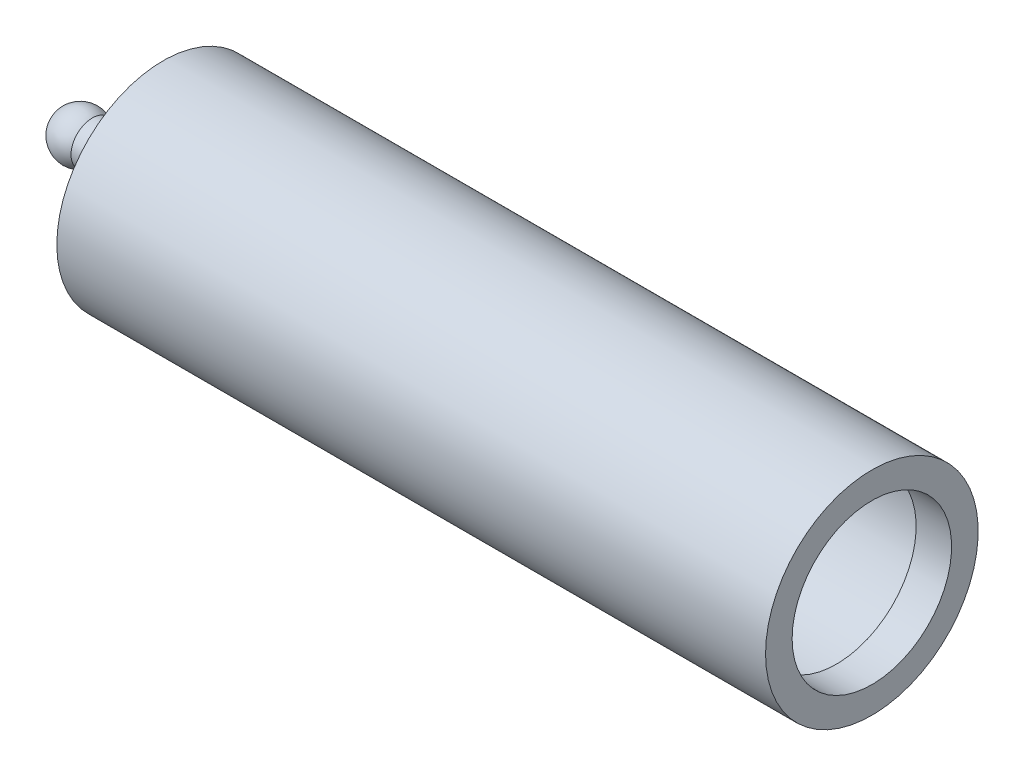
ISO-10303-21;
HEADER;
FILE_DESCRIPTION(('STEP AP214'),'2;1');
FILE_NAME('part.step','',(''),(''),'','','');
FILE_SCHEMA(('AUTOMOTIVE_DESIGN { 1 0 10303 214 1 1 1 1 }'));
ENDSEC;
DATA;
#1=APPLICATION_CONTEXT('core data for automotive mechanical design processes');
#2=APPLICATION_PROTOCOL_DEFINITION('international standard','automotive_design',2000,#1);
#3=PRODUCT_CONTEXT('',#1,'mechanical');
#4=PRODUCT('Part','Part','',(#3));
#5=PRODUCT_RELATED_PRODUCT_CATEGORY('part','',(#4));
#6=PRODUCT_DEFINITION_FORMATION('','',#4);
#7=PRODUCT_DEFINITION_CONTEXT('part definition',#1,'design');
#8=PRODUCT_DEFINITION('design','',#6,#7);
#9=PRODUCT_DEFINITION_SHAPE('','',#8);
#10=(LENGTH_UNIT() NAMED_UNIT(*) SI_UNIT(.MILLI.,.METRE.));
#11=(NAMED_UNIT(*) PLANE_ANGLE_UNIT() SI_UNIT($,.RADIAN.));
#12=(NAMED_UNIT(*) SI_UNIT($,.STERADIAN.) SOLID_ANGLE_UNIT());
#13=UNCERTAINTY_MEASURE_WITH_UNIT(LENGTH_MEASURE(1.E-05),#10,'distance_accuracy_value','');
#14=(GEOMETRIC_REPRESENTATION_CONTEXT(3) GLOBAL_UNCERTAINTY_ASSIGNED_CONTEXT((#13)) GLOBAL_UNIT_ASSIGNED_CONTEXT((#10,
#11,#12)) REPRESENTATION_CONTEXT('',''));
#15=CARTESIAN_POINT('',(0.,0.,0.));
#16=DIRECTION('',(0.,0.,1.));
#17=DIRECTION('',(1.,0.,0.));
#18=AXIS2_PLACEMENT_3D('',#15,#16,#17);
#19=CARTESIAN_POINT('',(-220.,0.,0.));
#20=DIRECTION('',(-1.,0.,0.));
#21=DIRECTION('',(0.,0.,1.));
#22=AXIS2_PLACEMENT_3D('',#19,#20,#21);
#23=CYLINDRICAL_SURFACE('',#22,55.);
#24=CARTESIAN_POINT('',(200.,0.,0.));
#25=DIRECTION('',(-1.,0.,0.));
#26=DIRECTION('',(0.,0.,1.));
#27=AXIS2_PLACEMENT_3D('',#24,#25,#26);
#28=CIRCLE('',#27,55.);
#29=CARTESIAN_POINT('',(200.,0.,55.));
#30=VERTEX_POINT('',#29);
#31=EDGE_CURVE('E70',#30,#30,#28,.T.);
#32=ORIENTED_EDGE('',*,*,#31,.F.);
#33=EDGE_LOOP('',(#32));
#34=FACE_BOUND('',#33,.T.);
#35=CARTESIAN_POINT('',(-160.,0.,0.));
#36=DIRECTION('',(-1.,0.,0.));
#37=DIRECTION('',(0.,0.,1.));
#38=AXIS2_PLACEMENT_3D('',#35,#36,#37);
#39=CIRCLE('',#38,55.);
#40=CARTESIAN_POINT('',(-160.,0.,55.));
#41=VERTEX_POINT('',#40);
#42=EDGE_CURVE('E12',#41,#41,#39,.T.);
#43=ORIENTED_EDGE('',*,*,#42,.T.);
#44=EDGE_LOOP('',(#43));
#45=FACE_BOUND('',#44,.T.);
#46=ADVANCED_FACE('F42',(#34,#45),#23,.F.);
#47=CARTESIAN_POINT('',(-160.,0.,0.));
#48=DIRECTION('',(-1.,0.,0.));
#49=DIRECTION('',(0.,0.,1.));
#50=AXIS2_PLACEMENT_3D('',#47,#48,#49);
#51=PLANE('',#50);
#52=ORIENTED_EDGE('',*,*,#42,.F.);
#53=EDGE_LOOP('',(#52));
#54=FACE_BOUND('',#53,.T.);
#55=ADVANCED_FACE('F77',(#54),#51,.F.);
#56=CARTESIAN_POINT('',(-220.,0.,0.));
#57=DIRECTION('',(-1.,0.,0.));
#58=DIRECTION('',(0.,0.,1.));
#59=AXIS2_PLACEMENT_3D('',#56,#57,#58);
#60=CYLINDRICAL_SURFACE('',#59,12.);
#61=CARTESIAN_POINT('',(-220.,0.,0.));
#62=DIRECTION('',(-1.,0.,0.));
#63=DIRECTION('',(0.,0.,1.));
#64=AXIS2_PLACEMENT_3D('',#61,#62,#63);
#65=CIRCLE('',#64,12.);
#66=CARTESIAN_POINT('',(-220.,0.,12.));
#67=VERTEX_POINT('',#66);
#68=EDGE_CURVE('E48',#67,#67,#65,.T.);
#69=ORIENTED_EDGE('',*,*,#68,.F.);
#70=EDGE_LOOP('',(#69));
#71=FACE_BOUND('',#70,.T.);
#72=CARTESIAN_POINT('',(-180.,0.,0.));
#73=DIRECTION('',(-1.,0.,0.));
#74=DIRECTION('',(0.,0.,1.));
#75=AXIS2_PLACEMENT_3D('',#72,#73,#74);
#76=CIRCLE('',#75,12.);
#77=CARTESIAN_POINT('',(-180.,0.,12.));
#78=VERTEX_POINT('',#77);
#79=EDGE_CURVE('E52',#78,#78,#76,.T.);
#80=ORIENTED_EDGE('',*,*,#79,.T.);
#81=EDGE_LOOP('',(#80));
#82=FACE_BOUND('',#81,.T.);
#83=ADVANCED_FACE('F81',(#71,#82),#60,.T.);
#84=CARTESIAN_POINT('',(-180.,60.,0.));
#85=DIRECTION('',(1.,0.,0.));
#86=DIRECTION('',(0.,0.,-1.));
#87=AXIS2_PLACEMENT_3D('',#84,#85,#86);
#88=PLANE('',#87);
#89=ORIENTED_EDGE('',*,*,#79,.F.);
#90=EDGE_LOOP('',(#89));
#91=FACE_BOUND('',#90,.T.);
#92=CARTESIAN_POINT('',(-180.,0.,0.));
#93=DIRECTION('',(-1.,0.,0.));
#94=DIRECTION('',(0.,0.,1.));
#95=AXIS2_PLACEMENT_3D('',#92,#93,#94);
#96=CIRCLE('',#95,60.);
#97=CARTESIAN_POINT('',(-180.,0.,60.));
#98=VERTEX_POINT('',#97);
#99=EDGE_CURVE('E56',#98,#98,#96,.T.);
#100=ORIENTED_EDGE('',*,*,#99,.T.);
#101=EDGE_LOOP('',(#100));
#102=FACE_BOUND('',#101,.T.);
#103=ADVANCED_FACE('F86',(#91,#102),#88,.F.);
#104=CARTESIAN_POINT('',(-220.,0.,0.));
#105=DIRECTION('',(-1.,0.,0.));
#106=DIRECTION('',(0.,0.,1.));
#107=AXIS2_PLACEMENT_3D('',#104,#105,#106);
#108=CYLINDRICAL_SURFACE('',#107,60.);
#109=ORIENTED_EDGE('',*,*,#99,.F.);
#110=EDGE_LOOP('',(#109));
#111=FACE_BOUND('',#110,.T.);
#112=CARTESIAN_POINT('',(220.,0.,0.));
#113=DIRECTION('',(-1.,0.,0.));
#114=DIRECTION('',(0.,0.,1.));
#115=AXIS2_PLACEMENT_3D('',#112,#113,#114);
#116=CIRCLE('',#115,60.);
#117=CARTESIAN_POINT('',(220.,0.,60.));
#118=VERTEX_POINT('',#117);
#119=EDGE_CURVE('E61',#118,#118,#116,.T.);
#120=ORIENTED_EDGE('',*,*,#119,.T.);
#121=EDGE_LOOP('',(#120));
#122=FACE_BOUND('',#121,.T.);
#123=ADVANCED_FACE('F92',(#111,#122),#108,.T.);
#124=CARTESIAN_POINT('',(220.,45.,0.));
#125=DIRECTION('',(-1.,0.,0.));
#126=DIRECTION('',(0.,0.,1.));
#127=AXIS2_PLACEMENT_3D('',#124,#125,#126);
#128=PLANE('',#127);
#129=ORIENTED_EDGE('',*,*,#119,.F.);
#130=EDGE_LOOP('',(#129));
#131=FACE_BOUND('',#130,.T.);
#132=CARTESIAN_POINT('',(220.,0.,0.));
#133=DIRECTION('',(-1.,0.,0.));
#134=DIRECTION('',(0.,0.,1.));
#135=AXIS2_PLACEMENT_3D('',#132,#133,#134);
#136=CIRCLE('',#135,45.);
#137=CARTESIAN_POINT('',(220.,0.,45.));
#138=VERTEX_POINT('',#137);
#139=EDGE_CURVE('E64',#138,#138,#136,.T.);
#140=ORIENTED_EDGE('',*,*,#139,.T.);
#141=EDGE_LOOP('',(#140));
#142=FACE_BOUND('',#141,.T.);
#143=ADVANCED_FACE('F96',(#131,#142),#128,.F.);
#144=CARTESIAN_POINT('',(-220.,0.,0.));
#145=DIRECTION('',(-1.,0.,0.));
#146=DIRECTION('',(0.,0.,1.));
#147=AXIS2_PLACEMENT_3D('',#144,#145,#146);
#148=CYLINDRICAL_SURFACE('',#147,45.);
#149=ORIENTED_EDGE('',*,*,#139,.F.);
#150=EDGE_LOOP('',(#149));
#151=FACE_BOUND('',#150,.T.);
#152=CARTESIAN_POINT('',(200.,0.,0.));
#153=DIRECTION('',(-1.,0.,0.));
#154=DIRECTION('',(0.,0.,1.));
#155=AXIS2_PLACEMENT_3D('',#152,#153,#154);
#156=CIRCLE('',#155,45.);
#157=CARTESIAN_POINT('',(200.,0.,45.));
#158=VERTEX_POINT('',#157);
#159=EDGE_CURVE('E67',#158,#158,#156,.T.);
#160=ORIENTED_EDGE('',*,*,#159,.T.);
#161=EDGE_LOOP('',(#160));
#162=FACE_BOUND('',#161,.T.);
#163=ADVANCED_FACE('F100',(#151,#162),#148,.F.);
#164=CARTESIAN_POINT('',(200.,55.,0.));
#165=DIRECTION('',(1.,0.,0.));
#166=DIRECTION('',(0.,0.,-1.));
#167=AXIS2_PLACEMENT_3D('',#164,#165,#166);
#168=PLANE('',#167);
#169=ORIENTED_EDGE('',*,*,#159,.F.);
#170=EDGE_LOOP('',(#169));
#171=FACE_BOUND('',#170,.T.);
#172=ORIENTED_EDGE('',*,*,#31,.T.);
#173=EDGE_LOOP('',(#172));
#174=FACE_BOUND('',#173,.T.);
#175=ADVANCED_FACE('F74',(#171,#174),#168,.F.);
#176=CARTESIAN_POINT('',(-226.733320132,0.,0.));
#177=DIRECTION('',(-1.,0.,0.));
#178=DIRECTION('',(0.,1.,0.));
#179=AXIS2_PLACEMENT_3D('',#176,#177,#178);
#180=SPHERICAL_SURFACE('',#179,13.76);
#181=ORIENTED_EDGE('',*,*,#68,.T.);
#182=EDGE_LOOP('',(#181));
#183=FACE_BOUND('',#182,.T.);
#184=ADVANCED_FACE('F107',(#183),#180,.T.);
#185=CLOSED_SHELL('',(#46,#55,#83,#103,#123,#143,#163,#175,#184));
#186=MANIFOLD_SOLID_BREP('B2',#185);
#187=ADVANCED_BREP_SHAPE_REPRESENTATION('',(#18,#186),#14);
#188=SHAPE_DEFINITION_REPRESENTATION(#9,#187);
ENDSEC;
END-ISO-10303-21;
